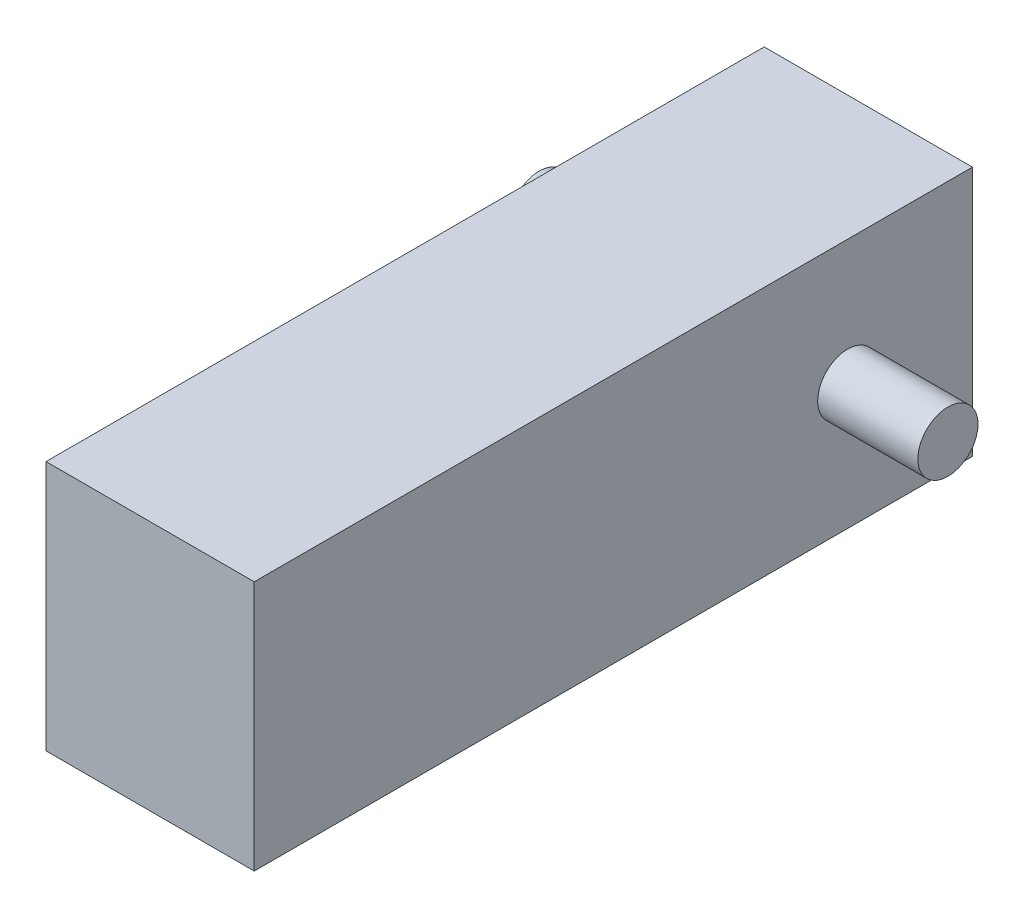
ISO-10303-21;
HEADER;
FILE_DESCRIPTION(('STEP AP214'),'2;1');
FILE_NAME('part.step','',(''),(''),'','','');
FILE_SCHEMA(('AUTOMOTIVE_DESIGN { 1 0 10303 214 1 1 1 1 }'));
ENDSEC;
DATA;
#1=APPLICATION_CONTEXT('core data for automotive mechanical design processes');
#2=APPLICATION_PROTOCOL_DEFINITION('international standard','automotive_design',2000,#1);
#3=PRODUCT_CONTEXT('',#1,'mechanical');
#4=PRODUCT('Part','Part','',(#3));
#5=PRODUCT_RELATED_PRODUCT_CATEGORY('part','',(#4));
#6=PRODUCT_DEFINITION_FORMATION('','',#4);
#7=PRODUCT_DEFINITION_CONTEXT('part definition',#1,'design');
#8=PRODUCT_DEFINITION('design','',#6,#7);
#9=PRODUCT_DEFINITION_SHAPE('','',#8);
#10=(LENGTH_UNIT() NAMED_UNIT(*) SI_UNIT(.MILLI.,.METRE.));
#11=(NAMED_UNIT(*) PLANE_ANGLE_UNIT() SI_UNIT($,.RADIAN.));
#12=(NAMED_UNIT(*) SI_UNIT($,.STERADIAN.) SOLID_ANGLE_UNIT());
#13=UNCERTAINTY_MEASURE_WITH_UNIT(LENGTH_MEASURE(1.E-05),#10,'distance_accuracy_value','');
#14=(GEOMETRIC_REPRESENTATION_CONTEXT(3) GLOBAL_UNCERTAINTY_ASSIGNED_CONTEXT((#13)) GLOBAL_UNIT_ASSIGNED_CONTEXT((#10,
#11,#12)) REPRESENTATION_CONTEXT('',''));
#15=CARTESIAN_POINT('',(0.,0.,0.));
#16=DIRECTION('',(0.,0.,1.));
#17=DIRECTION('',(1.,0.,0.));
#18=AXIS2_PLACEMENT_3D('',#15,#16,#17);
#19=CARTESIAN_POINT('',(9.35,22.5,32.25));
#20=DIRECTION('',(-1.,0.,0.));
#21=DIRECTION('',(0.,0.,1.));
#22=AXIS2_PLACEMENT_3D('',#19,#20,#21);
#23=PLANE('',#22);
#24=CARTESIAN_POINT('',(9.35,11.25,-21.05));
#25=DIRECTION('',(-1.,0.,0.));
#26=DIRECTION('',(0.,0.,1.));
#27=AXIS2_PLACEMENT_3D('',#24,#25,#26);
#28=CIRCLE('',#27,2.7);
#29=CARTESIAN_POINT('',(9.35,11.25,-18.35));
#30=VERTEX_POINT('',#29);
#31=EDGE_CURVE('E11',#30,#30,#28,.F.);
#32=ORIENTED_EDGE('',*,*,#31,.F.);
#33=EDGE_LOOP('',(#32));
#34=FACE_BOUND('',#33,.T.);
#35=DIRECTION('',(0.,0.,-1.));
#36=VECTOR('',#35,1.);
#37=CARTESIAN_POINT('',(9.35,0.,32.25));
#38=LINE('',#37,#36);
#39=CARTESIAN_POINT('',(9.35,0.,32.25));
#40=VERTEX_POINT('',#39);
#41=CARTESIAN_POINT('',(9.35,0.,-32.25));
#42=VERTEX_POINT('',#41);
#43=EDGE_CURVE('E106',#40,#42,#38,.T.);
#44=ORIENTED_EDGE('',*,*,#43,.T.);
#45=DIRECTION('',(0.,-1.,0.));
#46=VECTOR('',#45,1.);
#47=CARTESIAN_POINT('',(9.35,22.5,-32.25));
#48=LINE('',#47,#46);
#49=CARTESIAN_POINT('',(9.35,22.5,-32.25));
#50=VERTEX_POINT('',#49);
#51=EDGE_CURVE('E48',#50,#42,#48,.T.);
#52=ORIENTED_EDGE('',*,*,#51,.F.);
#53=DIRECTION('',(0.,0.,-1.));
#54=VECTOR('',#53,1.);
#55=CARTESIAN_POINT('',(9.35,22.5,32.25));
#56=LINE('',#55,#54);
#57=CARTESIAN_POINT('',(9.35,22.5,32.25));
#58=VERTEX_POINT('',#57);
#59=EDGE_CURVE('E92',#58,#50,#56,.T.);
#60=ORIENTED_EDGE('',*,*,#59,.F.);
#61=DIRECTION('',(0.,-1.,0.));
#62=VECTOR('',#61,1.);
#63=CARTESIAN_POINT('',(9.35,22.5,32.25));
#64=LINE('',#63,#62);
#65=EDGE_CURVE('E102',#58,#40,#64,.T.);
#66=ORIENTED_EDGE('',*,*,#65,.T.);
#67=EDGE_LOOP('',(#44,#52,#60,#66));
#68=FACE_BOUND('',#67,.T.);
#69=ADVANCED_FACE('F40',(#34,#68),#23,.F.);
#70=CARTESIAN_POINT('',(-9.35,22.5,-32.25));
#71=DIRECTION('',(0.,0.,1.));
#72=DIRECTION('',(1.,0.,0.));
#73=AXIS2_PLACEMENT_3D('',#70,#71,#72);
#74=PLANE('',#73);
#75=DIRECTION('',(-1.,0.,0.));
#76=VECTOR('',#75,1.);
#77=CARTESIAN_POINT('',(-9.35,0.,-32.25));
#78=LINE('',#77,#76);
#79=CARTESIAN_POINT('',(-9.35,0.,-32.25));
#80=VERTEX_POINT('',#79);
#81=EDGE_CURVE('E97',#42,#80,#78,.T.);
#82=ORIENTED_EDGE('',*,*,#81,.T.);
#83=DIRECTION('',(0.,-1.,0.));
#84=VECTOR('',#83,1.);
#85=CARTESIAN_POINT('',(-9.35,22.5,-32.25));
#86=LINE('',#85,#84);
#87=CARTESIAN_POINT('',(-9.35,22.5,-32.25));
#88=VERTEX_POINT('',#87);
#89=EDGE_CURVE('E95',#88,#80,#86,.T.);
#90=ORIENTED_EDGE('',*,*,#89,.F.);
#91=DIRECTION('',(-1.,0.,0.));
#92=VECTOR('',#91,1.);
#93=CARTESIAN_POINT('',(-9.35,22.5,-32.25));
#94=LINE('',#93,#92);
#95=EDGE_CURVE('E87',#50,#88,#94,.T.);
#96=ORIENTED_EDGE('',*,*,#95,.F.);
#97=ORIENTED_EDGE('',*,*,#51,.T.);
#98=EDGE_LOOP('',(#82,#90,#96,#97));
#99=FACE_BOUND('',#98,.T.);
#100=ADVANCED_FACE('F96',(#99),#74,.F.);
#101=CARTESIAN_POINT('',(-9.35,22.5,32.25));
#102=DIRECTION('',(1.,0.,0.));
#103=DIRECTION('',(0.,0.,-1.));
#104=AXIS2_PLACEMENT_3D('',#101,#102,#103);
#105=PLANE('',#104);
#106=CARTESIAN_POINT('',(-9.35,11.25,-21.05));
#107=DIRECTION('',(1.,0.,0.));
#108=DIRECTION('',(0.,0.,-1.));
#109=AXIS2_PLACEMENT_3D('',#106,#107,#108);
#110=CIRCLE('',#109,2.7);
#111=CARTESIAN_POINT('',(-9.35,11.25,-23.75));
#112=VERTEX_POINT('',#111);
#113=EDGE_CURVE('E232',#112,#112,#110,.T.);
#114=ORIENTED_EDGE('',*,*,#113,.T.);
#115=EDGE_LOOP('',(#114));
#116=FACE_BOUND('',#115,.T.);
#117=DIRECTION('',(0.,0.,1.));
#118=VECTOR('',#117,1.);
#119=CARTESIAN_POINT('',(-9.35,0.,32.25));
#120=LINE('',#119,#118);
#121=CARTESIAN_POINT('',(-9.35,0.,32.25));
#122=VERTEX_POINT('',#121);
#123=EDGE_CURVE('E73',#80,#122,#120,.T.);
#124=ORIENTED_EDGE('',*,*,#123,.T.);
#125=DIRECTION('',(0.,-1.,0.));
#126=VECTOR('',#125,1.);
#127=CARTESIAN_POINT('',(-9.35,22.5,32.25));
#128=LINE('',#127,#126);
#129=CARTESIAN_POINT('',(-9.35,22.5,32.25));
#130=VERTEX_POINT('',#129);
#131=EDGE_CURVE('E98',#130,#122,#128,.T.);
#132=ORIENTED_EDGE('',*,*,#131,.F.);
#133=DIRECTION('',(0.,0.,1.));
#134=VECTOR('',#133,1.);
#135=CARTESIAN_POINT('',(-9.35,22.5,32.25));
#136=LINE('',#135,#134);
#137=EDGE_CURVE('E90',#88,#130,#136,.T.);
#138=ORIENTED_EDGE('',*,*,#137,.F.);
#139=ORIENTED_EDGE('',*,*,#89,.T.);
#140=EDGE_LOOP('',(#124,#132,#138,#139));
#141=FACE_BOUND('',#140,.T.);
#142=ADVANCED_FACE('F100',(#116,#141),#105,.F.);
#143=CARTESIAN_POINT('',(-9.35,22.5,32.25));
#144=DIRECTION('',(0.,0.,-1.));
#145=DIRECTION('',(-1.,0.,0.));
#146=AXIS2_PLACEMENT_3D('',#143,#144,#145);
#147=PLANE('',#146);
#148=DIRECTION('',(1.,0.,0.));
#149=VECTOR('',#148,1.);
#150=CARTESIAN_POINT('',(-9.35,0.,32.25));
#151=LINE('',#150,#149);
#152=EDGE_CURVE('E79',#122,#40,#151,.T.);
#153=ORIENTED_EDGE('',*,*,#152,.T.);
#154=ORIENTED_EDGE('',*,*,#65,.F.);
#155=DIRECTION('',(1.,0.,0.));
#156=VECTOR('',#155,1.);
#157=CARTESIAN_POINT('',(-9.35,22.5,32.25));
#158=LINE('',#157,#156);
#159=EDGE_CURVE('E56',#130,#58,#158,.T.);
#160=ORIENTED_EDGE('',*,*,#159,.F.);
#161=ORIENTED_EDGE('',*,*,#131,.T.);
#162=EDGE_LOOP('',(#153,#154,#160,#161));
#163=FACE_BOUND('',#162,.T.);
#164=ADVANCED_FACE('F128',(#163),#147,.F.);
#165=CARTESIAN_POINT('',(0.,22.5,0.));
#166=DIRECTION('',(0.,-1.,0.));
#167=DIRECTION('',(0.,0.,-1.));
#168=AXIS2_PLACEMENT_3D('',#165,#166,#167);
#169=PLANE('',#168);
#170=ORIENTED_EDGE('',*,*,#59,.T.);
#171=ORIENTED_EDGE('',*,*,#95,.T.);
#172=ORIENTED_EDGE('',*,*,#137,.T.);
#173=ORIENTED_EDGE('',*,*,#159,.T.);
#174=EDGE_LOOP('',(#170,#171,#172,#173));
#175=FACE_BOUND('',#174,.T.);
#176=ADVANCED_FACE('F88',(#175),#169,.F.);
#177=CARTESIAN_POINT('',(0.,0.,0.));
#178=DIRECTION('',(0.,-1.,0.));
#179=DIRECTION('',(0.,0.,-1.));
#180=AXIS2_PLACEMENT_3D('',#177,#178,#179);
#181=PLANE('',#180);
#182=ORIENTED_EDGE('',*,*,#43,.F.);
#183=ORIENTED_EDGE('',*,*,#152,.F.);
#184=ORIENTED_EDGE('',*,*,#123,.F.);
#185=ORIENTED_EDGE('',*,*,#81,.F.);
#186=EDGE_LOOP('',(#182,#183,#184,#185));
#187=FACE_BOUND('',#186,.T.);
#188=ADVANCED_FACE('F117',(#187),#181,.T.);
#189=CARTESIAN_POINT('',(18.35,11.25,-21.05));
#190=DIRECTION('',(-1.,0.,0.));
#191=DIRECTION('',(0.,0.,1.));
#192=AXIS2_PLACEMENT_3D('',#189,#190,#191);
#193=CYLINDRICAL_SURFACE('',#192,2.7);
#194=CARTESIAN_POINT('',(18.35,11.25,-21.05));
#195=DIRECTION('',(1.,0.,0.));
#196=DIRECTION('',(0.,0.,-1.));
#197=AXIS2_PLACEMENT_3D('',#194,#195,#196);
#198=CIRCLE('',#197,2.7);
#199=CARTESIAN_POINT('',(18.35,11.25,-23.75));
#200=VERTEX_POINT('',#199);
#201=EDGE_CURVE('E109',#200,#200,#198,.T.);
#202=ORIENTED_EDGE('',*,*,#201,.F.);
#203=EDGE_LOOP('',(#202));
#204=FACE_BOUND('',#203,.T.);
#205=ORIENTED_EDGE('',*,*,#31,.T.);
#206=EDGE_LOOP('',(#205));
#207=FACE_BOUND('',#206,.T.);
#208=ADVANCED_FACE('F119',(#204,#207),#193,.T.);
#209=CARTESIAN_POINT('',(18.35,11.25,-21.05));
#210=DIRECTION('',(1.,0.,0.));
#211=DIRECTION('',(0.,0.,-1.));
#212=AXIS2_PLACEMENT_3D('',#209,#210,#211);
#213=PLANE('',#212);
#214=ORIENTED_EDGE('',*,*,#201,.T.);
#215=EDGE_LOOP('',(#214));
#216=FACE_BOUND('',#215,.T.);
#217=ADVANCED_FACE('F125',(#216),#213,.T.);
#218=CARTESIAN_POINT('',(-18.35,11.25,-21.05));
#219=DIRECTION('',(1.,0.,0.));
#220=DIRECTION('',(0.,0.,-1.));
#221=AXIS2_PLACEMENT_3D('',#218,#219,#220);
#222=CYLINDRICAL_SURFACE('',#221,2.7);
#223=CARTESIAN_POINT('',(-18.35,11.25,-21.05));
#224=DIRECTION('',(1.,0.,0.));
#225=DIRECTION('',(0.,0.,-1.));
#226=AXIS2_PLACEMENT_3D('',#223,#224,#225);
#227=CIRCLE('',#226,2.7);
#228=CARTESIAN_POINT('',(-18.35,11.25,-23.75));
#229=VERTEX_POINT('',#228);
#230=EDGE_CURVE('E231',#229,#229,#227,.T.);
#231=ORIENTED_EDGE('',*,*,#230,.T.);
#232=EDGE_LOOP('',(#231));
#233=FACE_BOUND('',#232,.T.);
#234=ORIENTED_EDGE('',*,*,#113,.F.);
#235=EDGE_LOOP('',(#234));
#236=FACE_BOUND('',#235,.T.);
#237=ADVANCED_FACE('F179',(#233,#236),#222,.T.);
#238=CARTESIAN_POINT('',(-18.35,11.25,-21.05));
#239=DIRECTION('',(-1.,0.,0.));
#240=DIRECTION('',(0.,0.,-1.));
#241=AXIS2_PLACEMENT_3D('',#238,#239,#240);
#242=PLANE('',#241);
#243=ORIENTED_EDGE('',*,*,#230,.F.);
#244=EDGE_LOOP('',(#243));
#245=FACE_BOUND('',#244,.T.);
#246=ADVANCED_FACE('F196',(#245),#242,.T.);
#247=CLOSED_SHELL('',(#69,#100,#142,#164,#176,#188,#208,#217,#237,#246));
#248=MANIFOLD_SOLID_BREP('B2',#247);
#249=ADVANCED_BREP_SHAPE_REPRESENTATION('',(#18,#248),#14);
#250=SHAPE_DEFINITION_REPRESENTATION(#9,#249);
ENDSEC;
END-ISO-10303-21;
